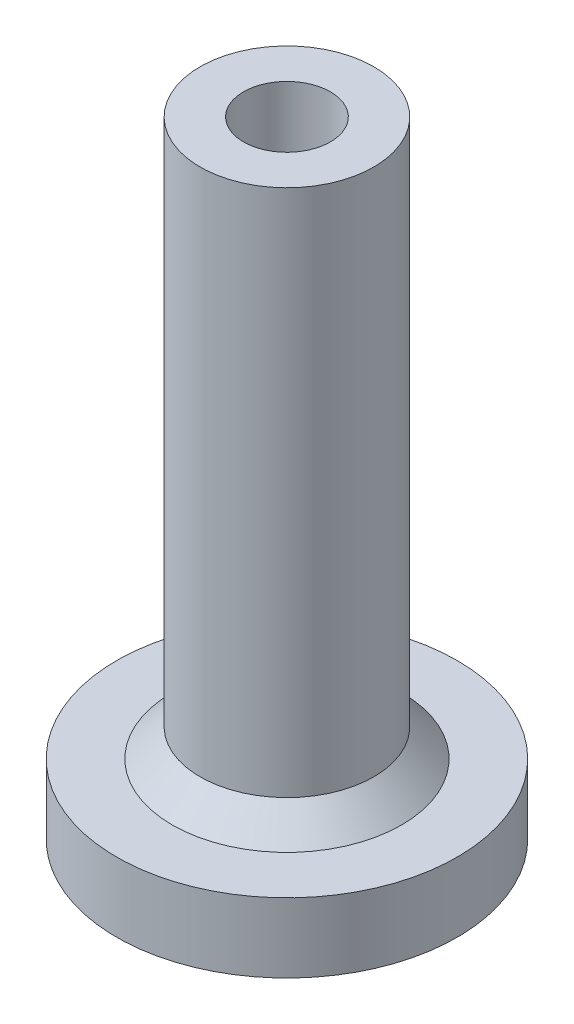
ISO-10303-21;
HEADER;
FILE_DESCRIPTION(('STEP AP214'),'2;1');
FILE_NAME('part.step','',(''),(''),'','','');
FILE_SCHEMA(('AUTOMOTIVE_DESIGN { 1 0 10303 214 1 1 1 1 }'));
ENDSEC;
DATA;
#1=APPLICATION_CONTEXT('core data for automotive mechanical design processes');
#2=APPLICATION_PROTOCOL_DEFINITION('international standard','automotive_design',2000,#1);
#3=PRODUCT_CONTEXT('',#1,'mechanical');
#4=PRODUCT('Part','Part','',(#3));
#5=PRODUCT_RELATED_PRODUCT_CATEGORY('part','',(#4));
#6=PRODUCT_DEFINITION_FORMATION('','',#4);
#7=PRODUCT_DEFINITION_CONTEXT('part definition',#1,'design');
#8=PRODUCT_DEFINITION('design','',#6,#7);
#9=PRODUCT_DEFINITION_SHAPE('','',#8);
#10=(LENGTH_UNIT() NAMED_UNIT(*) SI_UNIT(.MILLI.,.METRE.));
#11=(NAMED_UNIT(*) PLANE_ANGLE_UNIT() SI_UNIT($,.RADIAN.));
#12=(NAMED_UNIT(*) SI_UNIT($,.STERADIAN.) SOLID_ANGLE_UNIT());
#13=UNCERTAINTY_MEASURE_WITH_UNIT(LENGTH_MEASURE(1.E-05),#10,'distance_accuracy_value','');
#14=(GEOMETRIC_REPRESENTATION_CONTEXT(3) GLOBAL_UNCERTAINTY_ASSIGNED_CONTEXT((#13)) GLOBAL_UNIT_ASSIGNED_CONTEXT((#10,
#11,#12)) REPRESENTATION_CONTEXT('',''));
#15=CARTESIAN_POINT('',(0.,0.,0.));
#16=DIRECTION('',(0.,0.,1.));
#17=DIRECTION('',(1.,0.,0.));
#18=AXIS2_PLACEMENT_3D('',#15,#16,#17);
#19=CARTESIAN_POINT('',(-4.9,0.,0.));
#20=DIRECTION('',(0.,1.,0.));
#21=DIRECTION('',(0.,0.,1.));
#22=AXIS2_PLACEMENT_3D('',#19,#20,#21);
#23=PLANE('',#22);
#24=CARTESIAN_POINT('',(0.,0.,0.));
#25=DIRECTION('',(0.,-1.,0.));
#26=DIRECTION('',(0.,0.,-1.));
#27=AXIS2_PLACEMENT_3D('',#24,#25,#26);
#28=CIRCLE('',#27,1.25);
#29=CARTESIAN_POINT('',(0.,0.,-1.25));
#30=VERTEX_POINT('',#29);
#31=EDGE_CURVE('E10',#30,#30,#28,.T.);
#32=ORIENTED_EDGE('',*,*,#31,.F.);
#33=EDGE_LOOP('',(#32));
#34=FACE_BOUND('',#33,.T.);
#35=CARTESIAN_POINT('',(0.,0.,0.));
#36=DIRECTION('',(0.,-1.,0.));
#37=DIRECTION('',(0.,0.,-1.));
#38=AXIS2_PLACEMENT_3D('',#35,#36,#37);
#39=CIRCLE('',#38,4.9);
#40=CARTESIAN_POINT('',(0.,0.,-4.9));
#41=VERTEX_POINT('',#40);
#42=EDGE_CURVE('E64',#41,#41,#39,.T.);
#43=ORIENTED_EDGE('',*,*,#42,.T.);
#44=EDGE_LOOP('',(#43));
#45=FACE_BOUND('',#44,.T.);
#46=ADVANCED_FACE('F39',(#34,#45),#23,.F.);
#47=CARTESIAN_POINT('',(0.,0.,0.));
#48=DIRECTION('',(0.,-1.,0.));
#49=DIRECTION('',(0.,0.,-1.));
#50=AXIS2_PLACEMENT_3D('',#47,#48,#49);
#51=CYLINDRICAL_SURFACE('',#50,1.25);
#52=CARTESIAN_POINT('',(0.,18.,0.));
#53=DIRECTION('',(0.,-1.,0.));
#54=DIRECTION('',(0.,0.,-1.));
#55=AXIS2_PLACEMENT_3D('',#52,#53,#54);
#56=CIRCLE('',#55,1.25);
#57=CARTESIAN_POINT('',(0.,18.,-1.25));
#58=VERTEX_POINT('',#57);
#59=EDGE_CURVE('E45',#58,#58,#56,.T.);
#60=ORIENTED_EDGE('',*,*,#59,.F.);
#61=EDGE_LOOP('',(#60));
#62=FACE_BOUND('',#61,.T.);
#63=ORIENTED_EDGE('',*,*,#31,.T.);
#64=EDGE_LOOP('',(#63));
#65=FACE_BOUND('',#64,.T.);
#66=ADVANCED_FACE('F95',(#62,#65),#51,.F.);
#67=CARTESIAN_POINT('',(-1.25,18.,0.));
#68=DIRECTION('',(0.,-1.,0.));
#69=DIRECTION('',(0.,0.,-1.));
#70=AXIS2_PLACEMENT_3D('',#67,#68,#69);
#71=PLANE('',#70);
#72=CARTESIAN_POINT('',(0.,18.,0.));
#73=DIRECTION('',(0.,-1.,0.));
#74=DIRECTION('',(0.,0.,-1.));
#75=AXIS2_PLACEMENT_3D('',#72,#73,#74);
#76=CIRCLE('',#75,2.5);
#77=CARTESIAN_POINT('',(0.,18.,-2.5));
#78=VERTEX_POINT('',#77);
#79=EDGE_CURVE('E49',#78,#78,#76,.T.);
#80=ORIENTED_EDGE('',*,*,#79,.F.);
#81=EDGE_LOOP('',(#80));
#82=FACE_BOUND('',#81,.T.);
#83=ORIENTED_EDGE('',*,*,#59,.T.);
#84=EDGE_LOOP('',(#83));
#85=FACE_BOUND('',#84,.T.);
#86=ADVANCED_FACE('F90',(#82,#85),#71,.F.);
#87=CARTESIAN_POINT('',(0.,0.,0.));
#88=DIRECTION('',(0.,-1.,0.));
#89=DIRECTION('',(0.,0.,-1.));
#90=AXIS2_PLACEMENT_3D('',#87,#88,#89);
#91=CYLINDRICAL_SURFACE('',#90,2.5);
#92=CARTESIAN_POINT('',(0.,2.8,0.));
#93=DIRECTION('',(0.,-1.,0.));
#94=DIRECTION('',(0.,0.,-1.));
#95=AXIS2_PLACEMENT_3D('',#92,#93,#94);
#96=CIRCLE('',#95,2.5);
#97=CARTESIAN_POINT('',(0.,2.8,-2.5));
#98=VERTEX_POINT('',#97);
#99=EDGE_CURVE('E53',#98,#98,#96,.T.);
#100=ORIENTED_EDGE('',*,*,#99,.F.);
#101=EDGE_LOOP('',(#100));
#102=FACE_BOUND('',#101,.T.);
#103=ORIENTED_EDGE('',*,*,#79,.T.);
#104=EDGE_LOOP('',(#103));
#105=FACE_BOUND('',#104,.T.);
#106=ADVANCED_FACE('F84',(#102,#105),#91,.T.);
#107=CARTESIAN_POINT('',(0.,2.8,0.));
#108=DIRECTION('',(0.,-1.,0.));
#109=DIRECTION('',(0.,0.,-1.));
#110=AXIS2_PLACEMENT_3D('',#107,#108,#109);
#111=CONICAL_SURFACE('',#110,2.5,0.78539816339745);
#112=CARTESIAN_POINT('',(0.,2.,0.));
#113=DIRECTION('',(0.,-1.,0.));
#114=DIRECTION('',(0.,0.,-1.));
#115=AXIS2_PLACEMENT_3D('',#112,#113,#114);
#116=CIRCLE('',#115,3.3);
#117=CARTESIAN_POINT('',(0.,2.,-3.3));
#118=VERTEX_POINT('',#117);
#119=EDGE_CURVE('E58',#118,#118,#116,.T.);
#120=ORIENTED_EDGE('',*,*,#119,.F.);
#121=EDGE_LOOP('',(#120));
#122=FACE_BOUND('',#121,.T.);
#123=ORIENTED_EDGE('',*,*,#99,.T.);
#124=EDGE_LOOP('',(#123));
#125=FACE_BOUND('',#124,.T.);
#126=ADVANCED_FACE('F78',(#122,#125),#111,.T.);
#127=CARTESIAN_POINT('',(-3.3,2.,0.));
#128=DIRECTION('',(0.,-1.,0.));
#129=DIRECTION('',(0.,0.,-1.));
#130=AXIS2_PLACEMENT_3D('',#127,#128,#129);
#131=PLANE('',#130);
#132=CARTESIAN_POINT('',(0.,2.,0.));
#133=DIRECTION('',(0.,-1.,0.));
#134=DIRECTION('',(0.,0.,-1.));
#135=AXIS2_PLACEMENT_3D('',#132,#133,#134);
#136=CIRCLE('',#135,4.9);
#137=CARTESIAN_POINT('',(0.,2.,-4.9));
#138=VERTEX_POINT('',#137);
#139=EDGE_CURVE('E61',#138,#138,#136,.T.);
#140=ORIENTED_EDGE('',*,*,#139,.F.);
#141=EDGE_LOOP('',(#140));
#142=FACE_BOUND('',#141,.T.);
#143=ORIENTED_EDGE('',*,*,#119,.T.);
#144=EDGE_LOOP('',(#143));
#145=FACE_BOUND('',#144,.T.);
#146=ADVANCED_FACE('F72',(#142,#145),#131,.F.);
#147=CARTESIAN_POINT('',(0.,0.,0.));
#148=DIRECTION('',(0.,-1.,0.));
#149=DIRECTION('',(0.,0.,-1.));
#150=AXIS2_PLACEMENT_3D('',#147,#148,#149);
#151=CYLINDRICAL_SURFACE('',#150,4.9);
#152=ORIENTED_EDGE('',*,*,#42,.F.);
#153=EDGE_LOOP('',(#152));
#154=FACE_BOUND('',#153,.T.);
#155=ORIENTED_EDGE('',*,*,#139,.T.);
#156=EDGE_LOOP('',(#155));
#157=FACE_BOUND('',#156,.T.);
#158=ADVANCED_FACE('F69',(#154,#157),#151,.T.);
#159=CLOSED_SHELL('',(#46,#66,#86,#106,#126,#146,#158));
#160=MANIFOLD_SOLID_BREP('B2',#159);
#161=ADVANCED_BREP_SHAPE_REPRESENTATION('',(#18,#160),#14);
#162=SHAPE_DEFINITION_REPRESENTATION(#9,#161);
ENDSEC;
END-ISO-10303-21;
